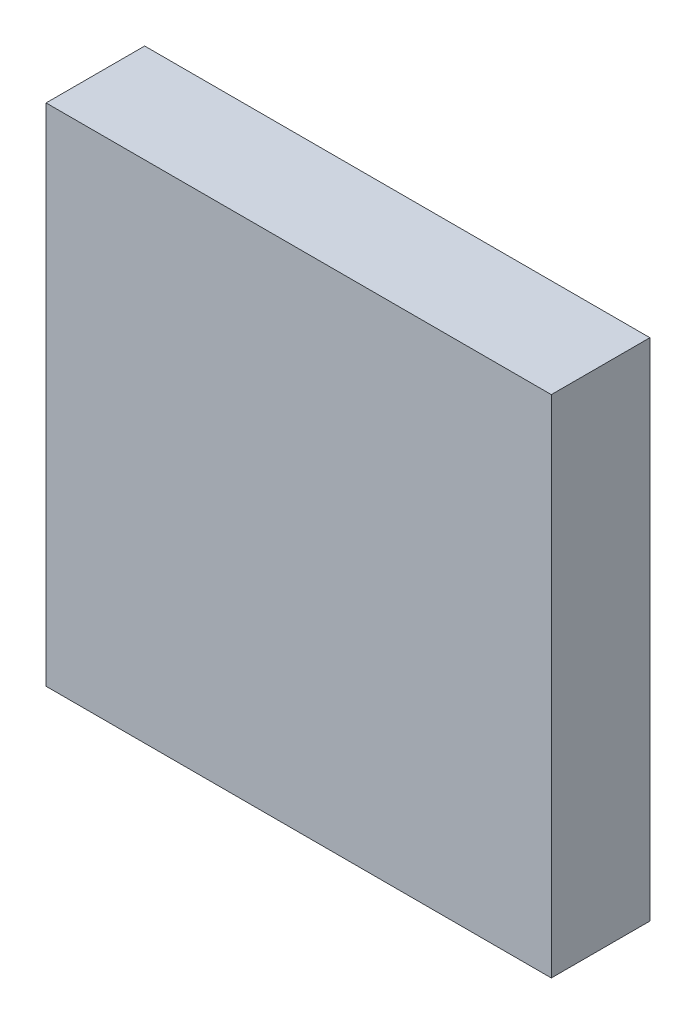
ISO-10303-21;
HEADER;
FILE_DESCRIPTION(('STEP AP214'),'2;1');
FILE_NAME('part.step','',(''),(''),'','','');
FILE_SCHEMA(('AUTOMOTIVE_DESIGN { 1 0 10303 214 1 1 1 1 }'));
ENDSEC;
DATA;
#1=APPLICATION_CONTEXT('core data for automotive mechanical design processes');
#2=APPLICATION_PROTOCOL_DEFINITION('international standard','automotive_design',2000,#1);
#3=PRODUCT_CONTEXT('',#1,'mechanical');
#4=PRODUCT('Part','Part','',(#3));
#5=PRODUCT_RELATED_PRODUCT_CATEGORY('part','',(#4));
#6=PRODUCT_DEFINITION_FORMATION('','',#4);
#7=PRODUCT_DEFINITION_CONTEXT('part definition',#1,'design');
#8=PRODUCT_DEFINITION('design','',#6,#7);
#9=PRODUCT_DEFINITION_SHAPE('','',#8);
#10=(LENGTH_UNIT() NAMED_UNIT(*) SI_UNIT(.MILLI.,.METRE.));
#11=(NAMED_UNIT(*) PLANE_ANGLE_UNIT() SI_UNIT($,.RADIAN.));
#12=(NAMED_UNIT(*) SI_UNIT($,.STERADIAN.) SOLID_ANGLE_UNIT());
#13=UNCERTAINTY_MEASURE_WITH_UNIT(LENGTH_MEASURE(1.E-05),#10,'distance_accuracy_value','');
#14=(GEOMETRIC_REPRESENTATION_CONTEXT(3) GLOBAL_UNCERTAINTY_ASSIGNED_CONTEXT((#13)) GLOBAL_UNIT_ASSIGNED_CONTEXT((#10,
#11,#12)) REPRESENTATION_CONTEXT('',''));
#15=CARTESIAN_POINT('',(0.,0.,0.));
#16=DIRECTION('',(0.,0.,1.));
#17=DIRECTION('',(1.,0.,0.));
#18=AXIS2_PLACEMENT_3D('',#15,#16,#17);
#19=CARTESIAN_POINT('',(-2.04999844,-2.04999844,0.80000094));
#20=DIRECTION('',(0.,0.,1.));
#21=DIRECTION('',(1.,0.,0.));
#22=AXIS2_PLACEMENT_3D('',#19,#20,#21);
#23=PLANE('',#22);
#24=DIRECTION('',(1.,0.,0.));
#25=VECTOR('',#24,1.);
#26=CARTESIAN_POINT('',(-2.04999844,2.05000098,0.80000094));
#27=LINE('',#26,#25);
#28=CARTESIAN_POINT('',(-2.04999844,2.05000098,0.80000094));
#29=VERTEX_POINT('',#28);
#30=CARTESIAN_POINT('',(2.05000098,2.05000098,0.80000094));
#31=VERTEX_POINT('',#30);
#32=EDGE_CURVE('E53',#29,#31,#27,.T.);
#33=ORIENTED_EDGE('',*,*,#32,.F.);
#34=DIRECTION('',(0.,1.,0.));
#35=VECTOR('',#34,1.);
#36=CARTESIAN_POINT('',(-2.04999844,-2.04999844,0.80000094));
#37=LINE('',#36,#35);
#38=CARTESIAN_POINT('',(-2.04999844,-2.04999844,0.80000094));
#39=VERTEX_POINT('',#38);
#40=EDGE_CURVE('E68',#39,#29,#37,.T.);
#41=ORIENTED_EDGE('',*,*,#40,.F.);
#42=DIRECTION('',(1.,0.,0.));
#43=VECTOR('',#42,1.);
#44=CARTESIAN_POINT('',(2.05000098,-2.04999844,0.80000094));
#45=LINE('',#44,#43);
#46=CARTESIAN_POINT('',(2.05000098,-2.04999844,0.80000094));
#47=VERTEX_POINT('',#46);
#48=EDGE_CURVE('E20',#47,#39,#45,.F.);
#49=ORIENTED_EDGE('',*,*,#48,.F.);
#50=DIRECTION('',(0.,1.,0.));
#51=VECTOR('',#50,1.);
#52=CARTESIAN_POINT('',(2.05000098,2.05000098,0.80000094));
#53=LINE('',#52,#51);
#54=EDGE_CURVE('E58',#31,#47,#53,.F.);
#55=ORIENTED_EDGE('',*,*,#54,.F.);
#56=EDGE_LOOP('',(#33,#41,#49,#55));
#57=FACE_BOUND('',#56,.T.);
#58=ADVANCED_FACE('F17',(#57),#23,.T.);
#59=CARTESIAN_POINT('',(2.05000098,-2.04999844,0.));
#60=DIRECTION('',(0.,-1.,0.));
#61=DIRECTION('',(0.,0.,-1.));
#62=AXIS2_PLACEMENT_3D('',#59,#60,#61);
#63=PLANE('',#62);
#64=DIRECTION('',(0.,0.,1.));
#65=VECTOR('',#64,1.);
#66=CARTESIAN_POINT('',(-2.04999844,-2.04999844,0.));
#67=LINE('',#66,#65);
#68=CARTESIAN_POINT('',(-2.04999844,-2.04999844,0.));
#69=VERTEX_POINT('',#68);
#70=EDGE_CURVE('E79',#69,#39,#67,.T.);
#71=ORIENTED_EDGE('',*,*,#70,.F.);
#72=DIRECTION('',(1.,0.,0.));
#73=VECTOR('',#72,1.);
#74=CARTESIAN_POINT('',(-2.04999844,-2.04999844,0.));
#75=LINE('',#74,#73);
#76=CARTESIAN_POINT('',(2.05000098,-2.04999844,0.));
#77=VERTEX_POINT('',#76);
#78=EDGE_CURVE('E74',#69,#77,#75,.T.);
#79=ORIENTED_EDGE('',*,*,#78,.T.);
#80=DIRECTION('',(0.,0.,-1.));
#81=VECTOR('',#80,1.);
#82=CARTESIAN_POINT('',(2.05000098,-2.04999844,0.));
#83=LINE('',#82,#81);
#84=EDGE_CURVE('E63',#47,#77,#83,.T.);
#85=ORIENTED_EDGE('',*,*,#84,.F.);
#86=ORIENTED_EDGE('',*,*,#48,.T.);
#87=EDGE_LOOP('',(#71,#79,#85,#86));
#88=FACE_BOUND('',#87,.T.);
#89=ADVANCED_FACE('F73',(#88),#63,.T.);
#90=CARTESIAN_POINT('',(2.05000098,2.05000098,0.));
#91=DIRECTION('',(1.,0.,0.));
#92=DIRECTION('',(0.,0.,-1.));
#93=AXIS2_PLACEMENT_3D('',#90,#91,#92);
#94=PLANE('',#93);
#95=ORIENTED_EDGE('',*,*,#84,.T.);
#96=DIRECTION('',(0.,1.,0.));
#97=VECTOR('',#96,1.);
#98=CARTESIAN_POINT('',(2.05000098,-2.04999844,0.));
#99=LINE('',#98,#97);
#100=CARTESIAN_POINT('',(2.05000098,2.05000098,0.));
#101=VERTEX_POINT('',#100);
#102=EDGE_CURVE('E84',#77,#101,#99,.T.);
#103=ORIENTED_EDGE('',*,*,#102,.T.);
#104=DIRECTION('',(0.,0.,1.));
#105=VECTOR('',#104,1.);
#106=CARTESIAN_POINT('',(2.05000098,2.05000098,0.));
#107=LINE('',#106,#105);
#108=EDGE_CURVE('E65',#31,#101,#107,.F.);
#109=ORIENTED_EDGE('',*,*,#108,.F.);
#110=ORIENTED_EDGE('',*,*,#54,.T.);
#111=EDGE_LOOP('',(#95,#103,#109,#110));
#112=FACE_BOUND('',#111,.T.);
#113=ADVANCED_FACE('F60',(#112),#94,.T.);
#114=CARTESIAN_POINT('',(-2.04999844,2.05000098,0.));
#115=DIRECTION('',(0.,1.,0.));
#116=DIRECTION('',(0.,0.,1.));
#117=AXIS2_PLACEMENT_3D('',#114,#115,#116);
#118=PLANE('',#117);
#119=ORIENTED_EDGE('',*,*,#108,.T.);
#120=DIRECTION('',(1.,0.,0.));
#121=VECTOR('',#120,1.);
#122=CARTESIAN_POINT('',(-2.04999844,2.05000098,0.));
#123=LINE('',#122,#121);
#124=CARTESIAN_POINT('',(-2.04999844,2.05000098,0.));
#125=VERTEX_POINT('',#124);
#126=EDGE_CURVE('E26',#101,#125,#123,.F.);
#127=ORIENTED_EDGE('',*,*,#126,.T.);
#128=DIRECTION('',(0.,0.,1.));
#129=VECTOR('',#128,1.);
#130=CARTESIAN_POINT('',(-2.04999844,2.05000098,0.));
#131=LINE('',#130,#129);
#132=EDGE_CURVE('E34',#29,#125,#131,.F.);
#133=ORIENTED_EDGE('',*,*,#132,.F.);
#134=ORIENTED_EDGE('',*,*,#32,.T.);
#135=EDGE_LOOP('',(#119,#127,#133,#134));
#136=FACE_BOUND('',#135,.T.);
#137=ADVANCED_FACE('F88',(#136),#118,.T.);
#138=CARTESIAN_POINT('',(-2.04999844,-2.04999844,0.));
#139=DIRECTION('',(-1.,0.,0.));
#140=DIRECTION('',(0.,0.,1.));
#141=AXIS2_PLACEMENT_3D('',#138,#139,#140);
#142=PLANE('',#141);
#143=ORIENTED_EDGE('',*,*,#132,.T.);
#144=DIRECTION('',(0.,1.,0.));
#145=VECTOR('',#144,1.);
#146=CARTESIAN_POINT('',(-2.04999844,-2.04999844,0.));
#147=LINE('',#146,#145);
#148=EDGE_CURVE('E11',#125,#69,#147,.F.);
#149=ORIENTED_EDGE('',*,*,#148,.T.);
#150=ORIENTED_EDGE('',*,*,#70,.T.);
#151=ORIENTED_EDGE('',*,*,#40,.T.);
#152=EDGE_LOOP('',(#143,#149,#150,#151));
#153=FACE_BOUND('',#152,.T.);
#154=ADVANCED_FACE('F91',(#153),#142,.T.);
#155=CARTESIAN_POINT('',(-2.04999844,-2.04999844,0.));
#156=DIRECTION('',(0.,0.,1.));
#157=DIRECTION('',(1.,0.,0.));
#158=AXIS2_PLACEMENT_3D('',#155,#156,#157);
#159=PLANE('',#158);
#160=ORIENTED_EDGE('',*,*,#126,.F.);
#161=ORIENTED_EDGE('',*,*,#102,.F.);
#162=ORIENTED_EDGE('',*,*,#78,.F.);
#163=ORIENTED_EDGE('',*,*,#148,.F.);
#164=EDGE_LOOP('',(#160,#161,#162,#163));
#165=FACE_BOUND('',#164,.T.);
#166=ADVANCED_FACE('F90',(#165),#159,.F.);
#167=CLOSED_SHELL('',(#58,#89,#113,#137,#154,#166));
#168=MANIFOLD_SOLID_BREP('B1',#167);
#169=ADVANCED_BREP_SHAPE_REPRESENTATION('',(#18,#168),#14);
#170=SHAPE_DEFINITION_REPRESENTATION(#9,#169);
ENDSEC;
END-ISO-10303-21;
